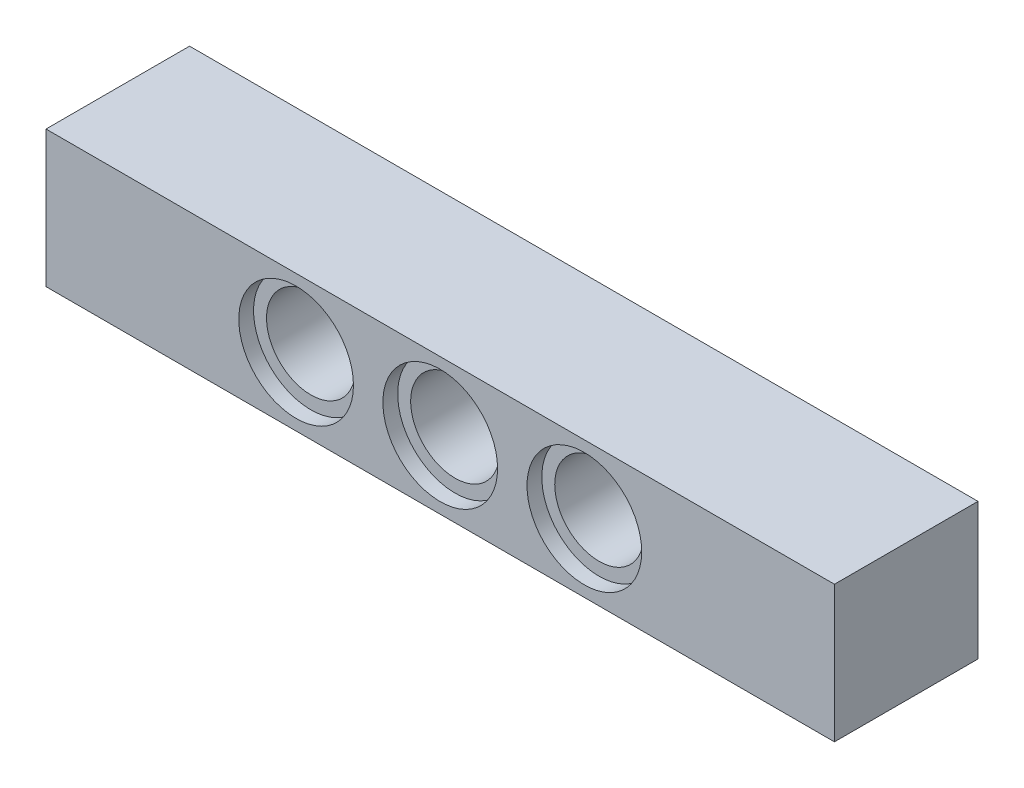
ISO-10303-21;
HEADER;
FILE_DESCRIPTION(('STEP AP214'),'2;1');
FILE_NAME('part.step','',(''),(''),'','','');
FILE_SCHEMA(('AUTOMOTIVE_DESIGN { 1 0 10303 214 1 1 1 1 }'));
ENDSEC;
DATA;
#1=APPLICATION_CONTEXT('core data for automotive mechanical design processes');
#2=APPLICATION_PROTOCOL_DEFINITION('international standard','automotive_design',2000,#1);
#3=PRODUCT_CONTEXT('',#1,'mechanical');
#4=PRODUCT('Part','Part','',(#3));
#5=PRODUCT_RELATED_PRODUCT_CATEGORY('part','',(#4));
#6=PRODUCT_DEFINITION_FORMATION('','',#4);
#7=PRODUCT_DEFINITION_CONTEXT('part definition',#1,'design');
#8=PRODUCT_DEFINITION('design','',#6,#7);
#9=PRODUCT_DEFINITION_SHAPE('','',#8);
#10=(LENGTH_UNIT() NAMED_UNIT(*) SI_UNIT(.MILLI.,.METRE.));
#11=(NAMED_UNIT(*) PLANE_ANGLE_UNIT() SI_UNIT($,.RADIAN.));
#12=(NAMED_UNIT(*) SI_UNIT($,.STERADIAN.) SOLID_ANGLE_UNIT());
#13=UNCERTAINTY_MEASURE_WITH_UNIT(LENGTH_MEASURE(1.E-05),#10,'distance_accuracy_value','');
#14=(GEOMETRIC_REPRESENTATION_CONTEXT(3) GLOBAL_UNCERTAINTY_ASSIGNED_CONTEXT((#13)) GLOBAL_UNIT_ASSIGNED_CONTEXT((#10,
#11,#12)) REPRESENTATION_CONTEXT('',''));
#15=CARTESIAN_POINT('',(0.,0.,0.));
#16=DIRECTION('',(0.,0.,1.));
#17=DIRECTION('',(1.,0.,0.));
#18=AXIS2_PLACEMENT_3D('',#15,#16,#17);
#19=CARTESIAN_POINT('',(27.29,3.69,0.));
#20=DIRECTION('',(0.,0.,1.));
#21=DIRECTION('',(1.,0.,0.));
#22=AXIS2_PLACEMENT_3D('',#19,#20,#21);
#23=CYLINDRICAL_SURFACE('',#22,3.1);
#24=CARTESIAN_POINT('',(27.29,3.69,0.));
#25=DIRECTION('',(0.,0.,1.));
#26=DIRECTION('',(1.,0.,0.));
#27=AXIS2_PLACEMENT_3D('',#24,#25,#26);
#28=CIRCLE('',#27,3.1);
#29=CARTESIAN_POINT('',(30.39,3.69,0.));
#30=VERTEX_POINT('',#29);
#31=EDGE_CURVE('E12',#30,#30,#28,.T.);
#32=ORIENTED_EDGE('',*,*,#31,.F.);
#33=EDGE_LOOP('',(#32));
#34=FACE_BOUND('',#33,.T.);
#35=CARTESIAN_POINT('',(27.29,3.69,0.8));
#36=DIRECTION('',(0.,0.,1.));
#37=DIRECTION('',(1.,0.,0.));
#38=AXIS2_PLACEMENT_3D('',#35,#36,#37);
#39=CIRCLE('',#38,3.1);
#40=CARTESIAN_POINT('',(30.39,3.69,0.8));
#41=VERTEX_POINT('',#40);
#42=EDGE_CURVE('E44',#41,#41,#39,.T.);
#43=ORIENTED_EDGE('',*,*,#42,.T.);
#44=EDGE_LOOP('',(#43));
#45=FACE_BOUND('',#44,.T.);
#46=ADVANCED_FACE('F36',(#34,#45),#23,.F.);
#47=CARTESIAN_POINT('',(7.79,0.,0.8));
#48=DIRECTION('',(0.,0.,1.));
#49=DIRECTION('',(1.,0.,0.));
#50=AXIS2_PLACEMENT_3D('',#47,#48,#49);
#51=PLANE('',#50);
#52=ORIENTED_EDGE('',*,*,#42,.F.);
#53=EDGE_LOOP('',(#52));
#54=FACE_BOUND('',#53,.T.);
#55=CARTESIAN_POINT('',(27.29,3.69,0.8));
#56=DIRECTION('',(0.,0.,1.));
#57=DIRECTION('',(1.,0.,0.));
#58=AXIS2_PLACEMENT_3D('',#55,#56,#57);
#59=CIRCLE('',#58,2.4);
#60=CARTESIAN_POINT('',(29.69,3.69,0.8));
#61=VERTEX_POINT('',#60);
#62=EDGE_CURVE('E153',#61,#61,#59,.F.);
#63=ORIENTED_EDGE('',*,*,#62,.F.);
#64=EDGE_LOOP('',(#63));
#65=FACE_BOUND('',#64,.T.);
#66=ADVANCED_FACE('F165',(#54,#65),#51,.F.);
#67=CARTESIAN_POINT('',(7.79,0.,6.95999999999999));
#68=DIRECTION('',(0.,0.,-1.));
#69=DIRECTION('',(-1.,0.,0.));
#70=AXIS2_PLACEMENT_3D('',#67,#68,#69);
#71=PLANE('',#70);
#72=CARTESIAN_POINT('',(27.29,3.69,6.96));
#73=DIRECTION('',(0.,0.,1.));
#74=DIRECTION('',(1.,0.,0.));
#75=AXIS2_PLACEMENT_3D('',#72,#73,#74);
#76=CIRCLE('',#75,3.1);
#77=CARTESIAN_POINT('',(30.39,3.69,6.96));
#78=VERTEX_POINT('',#77);
#79=EDGE_CURVE('E159',#78,#78,#76,.T.);
#80=ORIENTED_EDGE('',*,*,#79,.T.);
#81=EDGE_LOOP('',(#80));
#82=FACE_BOUND('',#81,.T.);
#83=CARTESIAN_POINT('',(27.29,3.69,6.95999999999999));
#84=DIRECTION('',(0.,0.,-1.));
#85=DIRECTION('',(-1.,0.,0.));
#86=AXIS2_PLACEMENT_3D('',#83,#84,#85);
#87=CIRCLE('',#86,2.4);
#88=CARTESIAN_POINT('',(24.89,3.69,6.95999999999999));
#89=VERTEX_POINT('',#88);
#90=EDGE_CURVE('E150',#89,#89,#87,.F.);
#91=ORIENTED_EDGE('',*,*,#90,.F.);
#92=EDGE_LOOP('',(#91));
#93=FACE_BOUND('',#92,.T.);
#94=ADVANCED_FACE('F168',(#82,#93),#71,.F.);
#95=CARTESIAN_POINT('',(27.29,3.69,7.76));
#96=DIRECTION('',(0.,0.,-1.));
#97=DIRECTION('',(-1.,0.,0.));
#98=AXIS2_PLACEMENT_3D('',#95,#96,#97);
#99=CYLINDRICAL_SURFACE('',#98,3.1);
#100=CARTESIAN_POINT('',(27.29,3.69,7.76));
#101=DIRECTION('',(0.,0.,1.));
#102=DIRECTION('',(1.,0.,0.));
#103=AXIS2_PLACEMENT_3D('',#100,#101,#102);
#104=CIRCLE('',#103,3.1);
#105=CARTESIAN_POINT('',(30.39,3.69,7.76));
#106=VERTEX_POINT('',#105);
#107=EDGE_CURVE('E156',#106,#106,#104,.T.);
#108=ORIENTED_EDGE('',*,*,#107,.T.);
#109=EDGE_LOOP('',(#108));
#110=FACE_BOUND('',#109,.T.);
#111=ORIENTED_EDGE('',*,*,#79,.F.);
#112=EDGE_LOOP('',(#111));
#113=FACE_BOUND('',#112,.T.);
#114=ADVANCED_FACE('F174',(#110,#113),#99,.F.);
#115=CARTESIAN_POINT('',(27.29,3.69,0.));
#116=DIRECTION('',(0.,0.,1.));
#117=DIRECTION('',(1.,0.,0.));
#118=AXIS2_PLACEMENT_3D('',#115,#116,#117);
#119=CYLINDRICAL_SURFACE('',#118,2.4);
#120=ORIENTED_EDGE('',*,*,#90,.T.);
#121=EDGE_LOOP('',(#120));
#122=FACE_BOUND('',#121,.T.);
#123=ORIENTED_EDGE('',*,*,#62,.T.);
#124=EDGE_LOOP('',(#123));
#125=FACE_BOUND('',#124,.T.);
#126=ADVANCED_FACE('F171',(#122,#125),#119,.F.);
#127=CARTESIAN_POINT('',(11.71,3.69,7.76));
#128=DIRECTION('',(0.,0.,-1.));
#129=DIRECTION('',(-1.,0.,0.));
#130=AXIS2_PLACEMENT_3D('',#127,#128,#129);
#131=CYLINDRICAL_SURFACE('',#130,3.1);
#132=CARTESIAN_POINT('',(11.71,3.69,7.76));
#133=DIRECTION('',(0.,0.,1.));
#134=DIRECTION('',(1.,0.,0.));
#135=AXIS2_PLACEMENT_3D('',#132,#133,#134);
#136=CIRCLE('',#135,3.1);
#137=CARTESIAN_POINT('',(14.81,3.69,7.76));
#138=VERTEX_POINT('',#137);
#139=EDGE_CURVE('E147',#138,#138,#136,.T.);
#140=ORIENTED_EDGE('',*,*,#139,.T.);
#141=EDGE_LOOP('',(#140));
#142=FACE_BOUND('',#141,.T.);
#143=CARTESIAN_POINT('',(11.71,3.69,6.96));
#144=DIRECTION('',(0.,0.,1.));
#145=DIRECTION('',(1.,0.,0.));
#146=AXIS2_PLACEMENT_3D('',#143,#144,#145);
#147=CIRCLE('',#146,3.1);
#148=CARTESIAN_POINT('',(14.81,3.69,6.96));
#149=VERTEX_POINT('',#148);
#150=EDGE_CURVE('E138',#149,#149,#147,.T.);
#151=ORIENTED_EDGE('',*,*,#150,.F.);
#152=EDGE_LOOP('',(#151));
#153=FACE_BOUND('',#152,.T.);
#154=ADVANCED_FACE('F173',(#142,#153),#131,.F.);
#155=CARTESIAN_POINT('',(-7.79,0.,0.8));
#156=DIRECTION('',(0.,0.,1.));
#157=DIRECTION('',(1.,0.,0.));
#158=AXIS2_PLACEMENT_3D('',#155,#156,#157);
#159=PLANE('',#158);
#160=CARTESIAN_POINT('',(11.71,3.69,0.8));
#161=DIRECTION('',(0.,0.,1.));
#162=DIRECTION('',(1.,0.,0.));
#163=AXIS2_PLACEMENT_3D('',#160,#161,#162);
#164=CIRCLE('',#163,3.1);
#165=CARTESIAN_POINT('',(14.81,3.69,0.8));
#166=VERTEX_POINT('',#165);
#167=EDGE_CURVE('E144',#166,#166,#164,.T.);
#168=ORIENTED_EDGE('',*,*,#167,.F.);
#169=EDGE_LOOP('',(#168));
#170=FACE_BOUND('',#169,.T.);
#171=CARTESIAN_POINT('',(11.71,3.69,0.8));
#172=DIRECTION('',(0.,0.,1.));
#173=DIRECTION('',(1.,0.,0.));
#174=AXIS2_PLACEMENT_3D('',#171,#172,#173);
#175=CIRCLE('',#174,2.4);
#176=CARTESIAN_POINT('',(14.11,3.69,0.8));
#177=VERTEX_POINT('',#176);
#178=EDGE_CURVE('E135',#177,#177,#175,.F.);
#179=ORIENTED_EDGE('',*,*,#178,.F.);
#180=EDGE_LOOP('',(#179));
#181=FACE_BOUND('',#180,.T.);
#182=ADVANCED_FACE('F181',(#170,#181),#159,.F.);
#183=CARTESIAN_POINT('',(11.71,3.69,0.));
#184=DIRECTION('',(0.,0.,1.));
#185=DIRECTION('',(1.,0.,0.));
#186=AXIS2_PLACEMENT_3D('',#183,#184,#185);
#187=CYLINDRICAL_SURFACE('',#186,3.1);
#188=CARTESIAN_POINT('',(11.71,3.69,0.));
#189=DIRECTION('',(0.,0.,1.));
#190=DIRECTION('',(1.,0.,0.));
#191=AXIS2_PLACEMENT_3D('',#188,#189,#190);
#192=CIRCLE('',#191,3.1);
#193=CARTESIAN_POINT('',(14.81,3.69,0.));
#194=VERTEX_POINT('',#193);
#195=EDGE_CURVE('E141',#194,#194,#192,.T.);
#196=ORIENTED_EDGE('',*,*,#195,.F.);
#197=EDGE_LOOP('',(#196));
#198=FACE_BOUND('',#197,.T.);
#199=ORIENTED_EDGE('',*,*,#167,.T.);
#200=EDGE_LOOP('',(#199));
#201=FACE_BOUND('',#200,.T.);
#202=ADVANCED_FACE('F234',(#198,#201),#187,.F.);
#203=CARTESIAN_POINT('',(-7.79,0.,6.95999999999999));
#204=DIRECTION('',(0.,0.,-1.));
#205=DIRECTION('',(-1.,0.,0.));
#206=AXIS2_PLACEMENT_3D('',#203,#204,#205);
#207=PLANE('',#206);
#208=ORIENTED_EDGE('',*,*,#150,.T.);
#209=EDGE_LOOP('',(#208));
#210=FACE_BOUND('',#209,.T.);
#211=CARTESIAN_POINT('',(11.71,3.69,6.95999999999999));
#212=DIRECTION('',(0.,0.,-1.));
#213=DIRECTION('',(-1.,0.,0.));
#214=AXIS2_PLACEMENT_3D('',#211,#212,#213);
#215=CIRCLE('',#214,2.4);
#216=CARTESIAN_POINT('',(9.31,3.69,6.95999999999999));
#217=VERTEX_POINT('',#216);
#218=EDGE_CURVE('E127',#217,#217,#215,.F.);
#219=ORIENTED_EDGE('',*,*,#218,.F.);
#220=EDGE_LOOP('',(#219));
#221=FACE_BOUND('',#220,.T.);
#222=ADVANCED_FACE('F230',(#210,#221),#207,.F.);
#223=CARTESIAN_POINT('',(11.71,3.69,0.));
#224=DIRECTION('',(0.,0.,1.));
#225=DIRECTION('',(1.,0.,0.));
#226=AXIS2_PLACEMENT_3D('',#223,#224,#225);
#227=CYLINDRICAL_SURFACE('',#226,2.4);
#228=ORIENTED_EDGE('',*,*,#218,.T.);
#229=EDGE_LOOP('',(#228));
#230=FACE_BOUND('',#229,.T.);
#231=ORIENTED_EDGE('',*,*,#178,.T.);
#232=EDGE_LOOP('',(#231));
#233=FACE_BOUND('',#232,.T.);
#234=ADVANCED_FACE('F226',(#230,#233),#227,.F.);
#235=CARTESIAN_POINT('',(0.,0.,7.76));
#236=DIRECTION('',(0.,1.,0.));
#237=DIRECTION('',(0.,0.,1.));
#238=AXIS2_PLACEMENT_3D('',#235,#236,#237);
#239=PLANE('',#238);
#240=DIRECTION('',(1.,0.,0.));
#241=VECTOR('',#240,1.);
#242=CARTESIAN_POINT('',(0.,0.,0.));
#243=LINE('',#242,#241);
#244=CARTESIAN_POINT('',(-1.81000000000004,0.,0.));
#245=VERTEX_POINT('',#244);
#246=CARTESIAN_POINT('',(40.81,0.,0.));
#247=VERTEX_POINT('',#246);
#248=EDGE_CURVE('E85',#245,#247,#243,.T.);
#249=ORIENTED_EDGE('',*,*,#248,.T.);
#250=DIRECTION('',(0.,0.,-1.));
#251=VECTOR('',#250,1.);
#252=CARTESIAN_POINT('',(40.81,0.,7.76));
#253=LINE('',#252,#251);
#254=CARTESIAN_POINT('',(40.81,0.,7.76));
#255=VERTEX_POINT('',#254);
#256=EDGE_CURVE('E107',#255,#247,#253,.T.);
#257=ORIENTED_EDGE('',*,*,#256,.F.);
#258=DIRECTION('',(1.,0.,0.));
#259=VECTOR('',#258,1.);
#260=CARTESIAN_POINT('',(0.,0.,7.76));
#261=LINE('',#260,#259);
#262=CARTESIAN_POINT('',(-1.81000000000004,0.,7.76));
#263=VERTEX_POINT('',#262);
#264=EDGE_CURVE('E52',#263,#255,#261,.T.);
#265=ORIENTED_EDGE('',*,*,#264,.F.);
#266=DIRECTION('',(0.,0.,-1.));
#267=VECTOR('',#266,1.);
#268=CARTESIAN_POINT('',(-1.81000000000004,0.,7.76));
#269=LINE('',#268,#267);
#270=EDGE_CURVE('E94',#263,#245,#269,.T.);
#271=ORIENTED_EDGE('',*,*,#270,.T.);
#272=EDGE_LOOP('',(#249,#257,#265,#271));
#273=FACE_BOUND('',#272,.T.);
#274=ADVANCED_FACE('F223',(#273),#239,.F.);
#275=CARTESIAN_POINT('',(0.,7.38,7.76));
#276=DIRECTION('',(0.,-1.,0.));
#277=DIRECTION('',(0.,0.,-1.));
#278=AXIS2_PLACEMENT_3D('',#275,#276,#277);
#279=PLANE('',#278);
#280=DIRECTION('',(-1.,0.,0.));
#281=VECTOR('',#280,1.);
#282=CARTESIAN_POINT('',(0.,7.38,7.76));
#283=LINE('',#282,#281);
#284=CARTESIAN_POINT('',(40.81,7.38,7.76));
#285=VERTEX_POINT('',#284);
#286=CARTESIAN_POINT('',(-1.81000000000004,7.38,7.76));
#287=VERTEX_POINT('',#286);
#288=EDGE_CURVE('E70',#285,#287,#283,.T.);
#289=ORIENTED_EDGE('',*,*,#288,.F.);
#290=DIRECTION('',(0.,0.,-1.));
#291=VECTOR('',#290,1.);
#292=CARTESIAN_POINT('',(40.81,7.38,7.76));
#293=LINE('',#292,#291);
#294=CARTESIAN_POINT('',(40.81,7.38,0.));
#295=VERTEX_POINT('',#294);
#296=EDGE_CURVE('E83',#285,#295,#293,.T.);
#297=ORIENTED_EDGE('',*,*,#296,.T.);
#298=DIRECTION('',(-1.,0.,0.));
#299=VECTOR('',#298,1.);
#300=CARTESIAN_POINT('',(0.,7.38,0.));
#301=LINE('',#300,#299);
#302=CARTESIAN_POINT('',(-1.81000000000004,7.38,0.));
#303=VERTEX_POINT('',#302);
#304=EDGE_CURVE('E64',#295,#303,#301,.T.);
#305=ORIENTED_EDGE('',*,*,#304,.T.);
#306=DIRECTION('',(0.,0.,-1.));
#307=VECTOR('',#306,1.);
#308=CARTESIAN_POINT('',(-1.81000000000004,7.38,7.76));
#309=LINE('',#308,#307);
#310=EDGE_CURVE('E80',#287,#303,#309,.T.);
#311=ORIENTED_EDGE('',*,*,#310,.F.);
#312=EDGE_LOOP('',(#289,#297,#305,#311));
#313=FACE_BOUND('',#312,.T.);
#314=ADVANCED_FACE('F79',(#313),#279,.F.);
#315=CARTESIAN_POINT('',(0.,0.,7.76));
#316=DIRECTION('',(0.,0.,-1.));
#317=DIRECTION('',(-1.,0.,0.));
#318=AXIS2_PLACEMENT_3D('',#315,#316,#317);
#319=PLANE('',#318);
#320=DIRECTION('',(0.,1.,0.));
#321=VECTOR('',#320,1.);
#322=CARTESIAN_POINT('',(-1.81000000000004,0.,7.76));
#323=LINE('',#322,#321);
#324=EDGE_CURVE('E92',#263,#287,#323,.T.);
#325=ORIENTED_EDGE('',*,*,#324,.F.);
#326=ORIENTED_EDGE('',*,*,#264,.T.);
#327=DIRECTION('',(0.,-1.,0.));
#328=VECTOR('',#327,1.);
#329=CARTESIAN_POINT('',(40.81,0.,7.76));
#330=LINE('',#329,#328);
#331=EDGE_CURVE('E103',#285,#255,#330,.T.);
#332=ORIENTED_EDGE('',*,*,#331,.F.);
#333=ORIENTED_EDGE('',*,*,#288,.T.);
#334=EDGE_LOOP('',(#325,#326,#332,#333));
#335=FACE_BOUND('',#334,.T.);
#336=ORIENTED_EDGE('',*,*,#107,.F.);
#337=EDGE_LOOP('',(#336));
#338=FACE_BOUND('',#337,.T.);
#339=ORIENTED_EDGE('',*,*,#139,.F.);
#340=EDGE_LOOP('',(#339));
#341=FACE_BOUND('',#340,.T.);
#342=CARTESIAN_POINT('',(19.5,3.69,7.76));
#343=DIRECTION('',(0.,0.,1.));
#344=DIRECTION('',(1.,0.,0.));
#345=AXIS2_PLACEMENT_3D('',#342,#343,#344);
#346=CIRCLE('',#345,3.1);
#347=CARTESIAN_POINT('',(22.6,3.69,7.76));
#348=VERTEX_POINT('',#347);
#349=EDGE_CURVE('E110',#348,#348,#346,.T.);
#350=ORIENTED_EDGE('',*,*,#349,.F.);
#351=EDGE_LOOP('',(#350));
#352=FACE_BOUND('',#351,.T.);
#353=ADVANCED_FACE('F194',(#335,#338,#341,#352),#319,.F.);
#354=CARTESIAN_POINT('',(0.,0.,0.));
#355=DIRECTION('',(0.,0.,-1.));
#356=DIRECTION('',(-1.,0.,0.));
#357=AXIS2_PLACEMENT_3D('',#354,#355,#356);
#358=PLANE('',#357);
#359=ORIENTED_EDGE('',*,*,#248,.F.);
#360=DIRECTION('',(0.,1.,0.));
#361=VECTOR('',#360,1.);
#362=CARTESIAN_POINT('',(-1.81000000000004,0.,0.));
#363=LINE('',#362,#361);
#364=EDGE_CURVE('E91',#245,#303,#363,.T.);
#365=ORIENTED_EDGE('',*,*,#364,.T.);
#366=ORIENTED_EDGE('',*,*,#304,.F.);
#367=DIRECTION('',(0.,-1.,0.));
#368=VECTOR('',#367,1.);
#369=CARTESIAN_POINT('',(40.81,0.,0.));
#370=LINE('',#369,#368);
#371=EDGE_CURVE('E93',#295,#247,#370,.T.);
#372=ORIENTED_EDGE('',*,*,#371,.T.);
#373=EDGE_LOOP('',(#359,#365,#366,#372));
#374=FACE_BOUND('',#373,.T.);
#375=ORIENTED_EDGE('',*,*,#31,.T.);
#376=EDGE_LOOP('',(#375));
#377=FACE_BOUND('',#376,.T.);
#378=ORIENTED_EDGE('',*,*,#195,.T.);
#379=EDGE_LOOP('',(#378));
#380=FACE_BOUND('',#379,.T.);
#381=CARTESIAN_POINT('',(19.5,3.69,0.));
#382=DIRECTION('',(0.,0.,1.));
#383=DIRECTION('',(1.,0.,0.));
#384=AXIS2_PLACEMENT_3D('',#381,#382,#383);
#385=CIRCLE('',#384,3.1);
#386=CARTESIAN_POINT('',(22.6,3.69,0.));
#387=VERTEX_POINT('',#386);
#388=EDGE_CURVE('E118',#387,#387,#385,.T.);
#389=ORIENTED_EDGE('',*,*,#388,.T.);
#390=EDGE_LOOP('',(#389));
#391=FACE_BOUND('',#390,.T.);
#392=ADVANCED_FACE('F96',(#374,#377,#380,#391),#358,.T.);
#393=CARTESIAN_POINT('',(19.5,3.69,0.));
#394=DIRECTION('',(0.,0.,1.));
#395=DIRECTION('',(1.,0.,0.));
#396=AXIS2_PLACEMENT_3D('',#393,#394,#395);
#397=CYLINDRICAL_SURFACE('',#396,2.4);
#398=CARTESIAN_POINT('',(19.5,3.69,6.95999999999999));
#399=DIRECTION('',(0.,0.,-1.));
#400=DIRECTION('',(-1.,0.,0.));
#401=AXIS2_PLACEMENT_3D('',#398,#399,#400);
#402=CIRCLE('',#401,2.4);
#403=CARTESIAN_POINT('',(17.1,3.69,6.95999999999999));
#404=VERTEX_POINT('',#403);
#405=EDGE_CURVE('E117',#404,#404,#402,.F.);
#406=ORIENTED_EDGE('',*,*,#405,.T.);
#407=EDGE_LOOP('',(#406));
#408=FACE_BOUND('',#407,.T.);
#409=CARTESIAN_POINT('',(19.5,3.69,0.8));
#410=DIRECTION('',(0.,0.,1.));
#411=DIRECTION('',(1.,0.,0.));
#412=AXIS2_PLACEMENT_3D('',#409,#410,#411);
#413=CIRCLE('',#412,2.4);
#414=CARTESIAN_POINT('',(21.9,3.69,0.8));
#415=VERTEX_POINT('',#414);
#416=EDGE_CURVE('E124',#415,#415,#413,.F.);
#417=ORIENTED_EDGE('',*,*,#416,.T.);
#418=EDGE_LOOP('',(#417));
#419=FACE_BOUND('',#418,.T.);
#420=ADVANCED_FACE('F193',(#408,#419),#397,.F.);
#421=CARTESIAN_POINT('',(0.,0.,0.8));
#422=DIRECTION('',(0.,0.,1.));
#423=DIRECTION('',(1.,0.,0.));
#424=AXIS2_PLACEMENT_3D('',#421,#422,#423);
#425=PLANE('',#424);
#426=CARTESIAN_POINT('',(19.5,3.69,0.8));
#427=DIRECTION('',(0.,0.,1.));
#428=DIRECTION('',(1.,0.,0.));
#429=AXIS2_PLACEMENT_3D('',#426,#427,#428);
#430=CIRCLE('',#429,3.1);
#431=CARTESIAN_POINT('',(22.6,3.69,0.8));
#432=VERTEX_POINT('',#431);
#433=EDGE_CURVE('E121',#432,#432,#430,.T.);
#434=ORIENTED_EDGE('',*,*,#433,.F.);
#435=EDGE_LOOP('',(#434));
#436=FACE_BOUND('',#435,.T.);
#437=ORIENTED_EDGE('',*,*,#416,.F.);
#438=EDGE_LOOP('',(#437));
#439=FACE_BOUND('',#438,.T.);
#440=ADVANCED_FACE('F204',(#436,#439),#425,.F.);
#441=CARTESIAN_POINT('',(19.5,3.69,0.));
#442=DIRECTION('',(0.,0.,1.));
#443=DIRECTION('',(1.,0.,0.));
#444=AXIS2_PLACEMENT_3D('',#441,#442,#443);
#445=CYLINDRICAL_SURFACE('',#444,3.1);
#446=ORIENTED_EDGE('',*,*,#388,.F.);
#447=EDGE_LOOP('',(#446));
#448=FACE_BOUND('',#447,.T.);
#449=ORIENTED_EDGE('',*,*,#433,.T.);
#450=EDGE_LOOP('',(#449));
#451=FACE_BOUND('',#450,.T.);
#452=ADVANCED_FACE('F200',(#448,#451),#445,.F.);
#453=CARTESIAN_POINT('',(0.,0.,6.95999999999999));
#454=DIRECTION('',(0.,0.,-1.));
#455=DIRECTION('',(-1.,0.,0.));
#456=AXIS2_PLACEMENT_3D('',#453,#454,#455);
#457=PLANE('',#456);
#458=CARTESIAN_POINT('',(19.5,3.69,6.96));
#459=DIRECTION('',(0.,0.,1.));
#460=DIRECTION('',(1.,0.,0.));
#461=AXIS2_PLACEMENT_3D('',#458,#459,#460);
#462=CIRCLE('',#461,3.1);
#463=CARTESIAN_POINT('',(22.6,3.69,6.96));
#464=VERTEX_POINT('',#463);
#465=EDGE_CURVE('E114',#464,#464,#462,.T.);
#466=ORIENTED_EDGE('',*,*,#465,.T.);
#467=EDGE_LOOP('',(#466));
#468=FACE_BOUND('',#467,.T.);
#469=ORIENTED_EDGE('',*,*,#405,.F.);
#470=EDGE_LOOP('',(#469));
#471=FACE_BOUND('',#470,.T.);
#472=ADVANCED_FACE('F203',(#468,#471),#457,.F.);
#473=CARTESIAN_POINT('',(19.5,3.69,7.76));
#474=DIRECTION('',(0.,0.,-1.));
#475=DIRECTION('',(-1.,0.,0.));
#476=AXIS2_PLACEMENT_3D('',#473,#474,#475);
#477=CYLINDRICAL_SURFACE('',#476,3.1);
#478=ORIENTED_EDGE('',*,*,#349,.T.);
#479=EDGE_LOOP('',(#478));
#480=FACE_BOUND('',#479,.T.);
#481=ORIENTED_EDGE('',*,*,#465,.F.);
#482=EDGE_LOOP('',(#481));
#483=FACE_BOUND('',#482,.T.);
#484=ADVANCED_FACE('F289',(#480,#483),#477,.F.);
#485=CARTESIAN_POINT('',(40.81,0.,7.76));
#486=DIRECTION('',(1.,0.,0.));
#487=DIRECTION('',(0.,0.,-1.));
#488=AXIS2_PLACEMENT_3D('',#485,#486,#487);
#489=PLANE('',#488);
#490=ORIENTED_EDGE('',*,*,#371,.F.);
#491=ORIENTED_EDGE('',*,*,#296,.F.);
#492=ORIENTED_EDGE('',*,*,#331,.T.);
#493=ORIENTED_EDGE('',*,*,#256,.T.);
#494=EDGE_LOOP('',(#490,#491,#492,#493));
#495=FACE_BOUND('',#494,.T.);
#496=ADVANCED_FACE('F285',(#495),#489,.T.);
#497=CARTESIAN_POINT('',(-1.81000000000004,0.,7.76));
#498=DIRECTION('',(-1.,0.,0.));
#499=DIRECTION('',(0.,0.,1.));
#500=AXIS2_PLACEMENT_3D('',#497,#498,#499);
#501=PLANE('',#500);
#502=ORIENTED_EDGE('',*,*,#364,.F.);
#503=ORIENTED_EDGE('',*,*,#270,.F.);
#504=ORIENTED_EDGE('',*,*,#324,.T.);
#505=ORIENTED_EDGE('',*,*,#310,.T.);
#506=EDGE_LOOP('',(#502,#503,#504,#505));
#507=FACE_BOUND('',#506,.T.);
#508=ADVANCED_FACE('F89',(#507),#501,.T.);
#509=CLOSED_SHELL('',(#46,#66,#94,#114,#126,#154,#182,#202,#222,#234,#274,#314,#353,#392,#420,
#440,#452,#472,#484,#496,#508));
#510=MANIFOLD_SOLID_BREP('B2',#509);
#511=ADVANCED_BREP_SHAPE_REPRESENTATION('',(#18,#510),#14);
#512=SHAPE_DEFINITION_REPRESENTATION(#9,#511);
ENDSEC;
END-ISO-10303-21;
